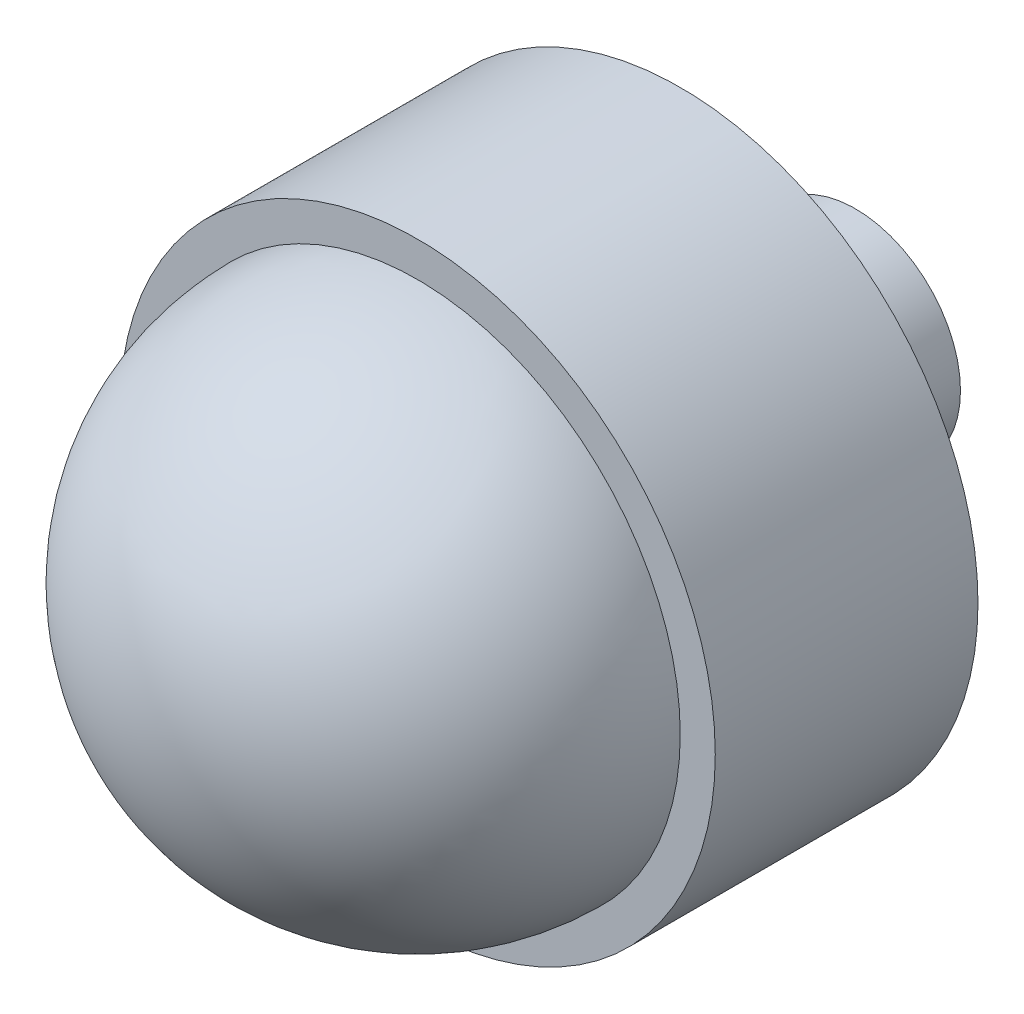
ISO-10303-21;
HEADER;
FILE_DESCRIPTION(('STEP AP214'),'2;1');
FILE_NAME('part.step','',(''),(''),'','','');
FILE_SCHEMA(('AUTOMOTIVE_DESIGN { 1 0 10303 214 1 1 1 1 }'));
ENDSEC;
DATA;
#1=APPLICATION_CONTEXT('core data for automotive mechanical design processes');
#2=APPLICATION_PROTOCOL_DEFINITION('international standard','automotive_design',2000,#1);
#3=PRODUCT_CONTEXT('',#1,'mechanical');
#4=PRODUCT('Part','Part','',(#3));
#5=PRODUCT_RELATED_PRODUCT_CATEGORY('part','',(#4));
#6=PRODUCT_DEFINITION_FORMATION('','',#4);
#7=PRODUCT_DEFINITION_CONTEXT('part definition',#1,'design');
#8=PRODUCT_DEFINITION('design','',#6,#7);
#9=PRODUCT_DEFINITION_SHAPE('','',#8);
#10=(LENGTH_UNIT() NAMED_UNIT(*) SI_UNIT(.MILLI.,.METRE.));
#11=(NAMED_UNIT(*) PLANE_ANGLE_UNIT() SI_UNIT($,.RADIAN.));
#12=(NAMED_UNIT(*) SI_UNIT($,.STERADIAN.) SOLID_ANGLE_UNIT());
#13=UNCERTAINTY_MEASURE_WITH_UNIT(LENGTH_MEASURE(1.E-05),#10,'distance_accuracy_value','');
#14=(GEOMETRIC_REPRESENTATION_CONTEXT(3) GLOBAL_UNCERTAINTY_ASSIGNED_CONTEXT((#13)) GLOBAL_UNIT_ASSIGNED_CONTEXT((#10,
#11,#12)) REPRESENTATION_CONTEXT('',''));
#15=CARTESIAN_POINT('',(0.,0.,0.));
#16=DIRECTION('',(0.,0.,1.));
#17=DIRECTION('',(1.,0.,0.));
#18=AXIS2_PLACEMENT_3D('',#15,#16,#17);
#19=CARTESIAN_POINT('',(0.,0.,-48.6993083397057));
#20=DIRECTION('',(0.,0.,1.));
#21=DIRECTION('',(1.,0.,0.));
#22=AXIS2_PLACEMENT_3D('',#19,#20,#21);
#23=SPHERICAL_SURFACE('',#22,15.);
#24=CARTESIAN_POINT('',(0.,0.,-48.6993083397057));
#25=DIRECTION('',(0.,0.,1.));
#26=DIRECTION('',(1.,0.,0.));
#27=AXIS2_PLACEMENT_3D('',#24,#25,#26);
#28=CIRCLE('',#27,15.);
#29=CARTESIAN_POINT('',(15.,0.,-48.6993083397057));
#30=VERTEX_POINT('',#29);
#31=EDGE_CURVE('E10',#30,#30,#28,.T.);
#32=ORIENTED_EDGE('',*,*,#31,.T.);
#33=EDGE_LOOP('',(#32));
#34=FACE_BOUND('',#33,.T.);
#35=ADVANCED_FACE('F31',(#34),#23,.T.);
#36=CARTESIAN_POINT('',(17.,0.,-48.6993083397057));
#37=DIRECTION('',(0.,0.,1.));
#38=DIRECTION('',(1.,0.,0.));
#39=AXIS2_PLACEMENT_3D('',#36,#37,#38);
#40=PLANE('',#39);
#41=CARTESIAN_POINT('',(0.,0.,-48.6993083397057));
#42=DIRECTION('',(0.,0.,1.));
#43=DIRECTION('',(1.,0.,0.));
#44=AXIS2_PLACEMENT_3D('',#41,#42,#43);
#45=CIRCLE('',#44,17.);
#46=CARTESIAN_POINT('',(17.,0.,-48.6993083397057));
#47=VERTEX_POINT('',#46);
#48=EDGE_CURVE('E37',#47,#47,#45,.T.);
#49=ORIENTED_EDGE('',*,*,#48,.T.);
#50=EDGE_LOOP('',(#49));
#51=FACE_BOUND('',#50,.T.);
#52=ORIENTED_EDGE('',*,*,#31,.F.);
#53=EDGE_LOOP('',(#52));
#54=FACE_BOUND('',#53,.T.);
#55=ADVANCED_FACE('F66',(#51,#54),#40,.T.);
#56=CARTESIAN_POINT('',(0.,0.,0.));
#57=DIRECTION('',(0.,0.,1.));
#58=DIRECTION('',(1.,0.,0.));
#59=AXIS2_PLACEMENT_3D('',#56,#57,#58);
#60=CYLINDRICAL_SURFACE('',#59,17.);
#61=CARTESIAN_POINT('',(0.,0.,-63.6993083397057));
#62=DIRECTION('',(0.,0.,1.));
#63=DIRECTION('',(1.,0.,0.));
#64=AXIS2_PLACEMENT_3D('',#61,#62,#63);
#65=CIRCLE('',#64,17.);
#66=CARTESIAN_POINT('',(17.,0.,-63.6993083397057));
#67=VERTEX_POINT('',#66);
#68=EDGE_CURVE('E41',#67,#67,#65,.T.);
#69=ORIENTED_EDGE('',*,*,#68,.T.);
#70=EDGE_LOOP('',(#69));
#71=FACE_BOUND('',#70,.T.);
#72=ORIENTED_EDGE('',*,*,#48,.F.);
#73=EDGE_LOOP('',(#72));
#74=FACE_BOUND('',#73,.T.);
#75=ADVANCED_FACE('F70',(#71,#74),#60,.T.);
#76=CARTESIAN_POINT('',(6.,0.,-63.6993083397057));
#77=DIRECTION('',(0.,0.,-1.));
#78=DIRECTION('',(-1.,0.,0.));
#79=AXIS2_PLACEMENT_3D('',#76,#77,#78);
#80=PLANE('',#79);
#81=CARTESIAN_POINT('',(0.,0.,-63.6993083397057));
#82=DIRECTION('',(0.,0.,1.));
#83=DIRECTION('',(1.,0.,0.));
#84=AXIS2_PLACEMENT_3D('',#81,#82,#83);
#85=CIRCLE('',#84,6.);
#86=CARTESIAN_POINT('',(6.,0.,-63.6993083397057));
#87=VERTEX_POINT('',#86);
#88=EDGE_CURVE('E45',#87,#87,#85,.T.);
#89=ORIENTED_EDGE('',*,*,#88,.T.);
#90=EDGE_LOOP('',(#89));
#91=FACE_BOUND('',#90,.T.);
#92=ORIENTED_EDGE('',*,*,#68,.F.);
#93=EDGE_LOOP('',(#92));
#94=FACE_BOUND('',#93,.T.);
#95=ADVANCED_FACE('F63',(#91,#94),#80,.T.);
#96=CARTESIAN_POINT('',(0.,0.,0.));
#97=DIRECTION('',(0.,0.,1.));
#98=DIRECTION('',(1.,0.,0.));
#99=AXIS2_PLACEMENT_3D('',#96,#97,#98);
#100=CYLINDRICAL_SURFACE('',#99,6.);
#101=CARTESIAN_POINT('',(0.,0.,-73.6993083397057));
#102=DIRECTION('',(0.,0.,1.));
#103=DIRECTION('',(1.,0.,0.));
#104=AXIS2_PLACEMENT_3D('',#101,#102,#103);
#105=CIRCLE('',#104,6.);
#106=CARTESIAN_POINT('',(6.,0.,-73.6993083397057));
#107=VERTEX_POINT('',#106);
#108=EDGE_CURVE('E50',#107,#107,#105,.T.);
#109=ORIENTED_EDGE('',*,*,#108,.T.);
#110=EDGE_LOOP('',(#109));
#111=FACE_BOUND('',#110,.T.);
#112=ORIENTED_EDGE('',*,*,#88,.F.);
#113=EDGE_LOOP('',(#112));
#114=FACE_BOUND('',#113,.T.);
#115=ADVANCED_FACE('F54',(#111,#114),#100,.T.);
#116=CARTESIAN_POINT('',(0.,0.,-73.6993083397057));
#117=DIRECTION('',(0.,0.,-1.));
#118=DIRECTION('',(-1.,0.,0.));
#119=AXIS2_PLACEMENT_3D('',#116,#117,#118);
#120=PLANE('',#119);
#121=ORIENTED_EDGE('',*,*,#108,.F.);
#122=EDGE_LOOP('',(#121));
#123=FACE_BOUND('',#122,.T.);
#124=ADVANCED_FACE('F57',(#123),#120,.T.);
#125=CLOSED_SHELL('',(#35,#55,#75,#95,#115,#124));
#126=MANIFOLD_SOLID_BREP('B2',#125);
#127=ADVANCED_BREP_SHAPE_REPRESENTATION('',(#18,#126),#14);
#128=SHAPE_DEFINITION_REPRESENTATION(#9,#127);
ENDSEC;
END-ISO-10303-21;
